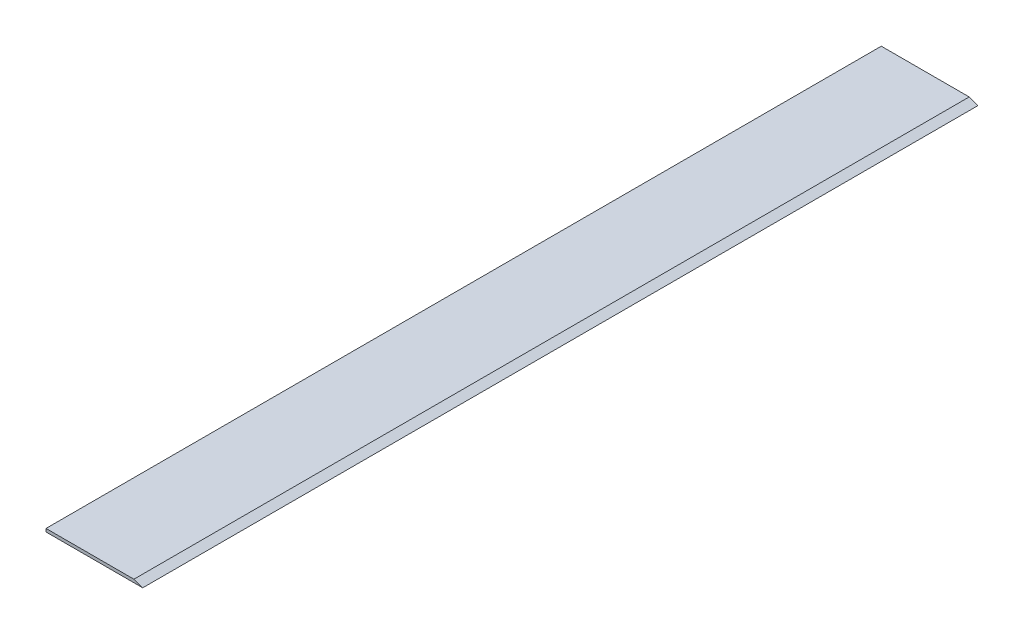
ISO-10303-21;
HEADER;
FILE_DESCRIPTION(('STEP AP214'),'2;1');
FILE_NAME('part.step','',(''),(''),'','','');
FILE_SCHEMA(('AUTOMOTIVE_DESIGN { 1 0 10303 214 1 1 1 1 }'));
ENDSEC;
DATA;
#1=APPLICATION_CONTEXT('core data for automotive mechanical design processes');
#2=APPLICATION_PROTOCOL_DEFINITION('international standard','automotive_design',2000,#1);
#3=PRODUCT_CONTEXT('',#1,'mechanical');
#4=PRODUCT('Part','Part','',(#3));
#5=PRODUCT_RELATED_PRODUCT_CATEGORY('part','',(#4));
#6=PRODUCT_DEFINITION_FORMATION('','',#4);
#7=PRODUCT_DEFINITION_CONTEXT('part definition',#1,'design');
#8=PRODUCT_DEFINITION('design','',#6,#7);
#9=PRODUCT_DEFINITION_SHAPE('','',#8);
#10=(LENGTH_UNIT() NAMED_UNIT(*) SI_UNIT(.MILLI.,.METRE.));
#11=(NAMED_UNIT(*) PLANE_ANGLE_UNIT() SI_UNIT($,.RADIAN.));
#12=(NAMED_UNIT(*) SI_UNIT($,.STERADIAN.) SOLID_ANGLE_UNIT());
#13=UNCERTAINTY_MEASURE_WITH_UNIT(LENGTH_MEASURE(1.E-05),#10,'distance_accuracy_value','');
#14=(GEOMETRIC_REPRESENTATION_CONTEXT(3) GLOBAL_UNCERTAINTY_ASSIGNED_CONTEXT((#13)) GLOBAL_UNIT_ASSIGNED_CONTEXT((#10,
#11,#12)) REPRESENTATION_CONTEXT('',''));
#15=CARTESIAN_POINT('',(0.,0.,0.));
#16=DIRECTION('',(0.,0.,1.));
#17=DIRECTION('',(1.,0.,0.));
#18=AXIS2_PLACEMENT_3D('',#15,#16,#17);
#19=CARTESIAN_POINT('',(0.,0.7,190.));
#20=DIRECTION('',(1.,0.,0.));
#21=DIRECTION('',(0.,0.,-1.));
#22=AXIS2_PLACEMENT_3D('',#19,#20,#21);
#23=PLANE('',#22);
#24=DIRECTION('',(0.,-1.,0.));
#25=VECTOR('',#24,1.);
#26=CARTESIAN_POINT('',(0.,0.7,0.));
#27=LINE('',#26,#25);
#28=CARTESIAN_POINT('',(0.,0.7,0.));
#29=VERTEX_POINT('',#28);
#30=CARTESIAN_POINT('',(0.,0.,0.));
#31=VERTEX_POINT('',#30);
#32=EDGE_CURVE('E109',#29,#31,#27,.T.);
#33=ORIENTED_EDGE('',*,*,#32,.T.);
#34=DIRECTION('',(0.,0.,-1.));
#35=VECTOR('',#34,1.);
#36=CARTESIAN_POINT('',(0.,0.,190.));
#37=LINE('',#36,#35);
#38=CARTESIAN_POINT('',(0.,0.,190.));
#39=VERTEX_POINT('',#38);
#40=EDGE_CURVE('E11',#39,#31,#37,.T.);
#41=ORIENTED_EDGE('',*,*,#40,.F.);
#42=DIRECTION('',(0.,-1.,0.));
#43=VECTOR('',#42,1.);
#44=CARTESIAN_POINT('',(0.,0.7,190.));
#45=LINE('',#44,#43);
#46=CARTESIAN_POINT('',(0.,0.7,190.));
#47=VERTEX_POINT('',#46);
#48=EDGE_CURVE('E92',#47,#39,#45,.T.);
#49=ORIENTED_EDGE('',*,*,#48,.F.);
#50=DIRECTION('',(0.,0.,-1.));
#51=VECTOR('',#50,1.);
#52=CARTESIAN_POINT('',(0.,0.7,190.));
#53=LINE('',#52,#51);
#54=EDGE_CURVE('E105',#47,#29,#53,.T.);
#55=ORIENTED_EDGE('',*,*,#54,.T.);
#56=EDGE_LOOP('',(#33,#41,#49,#55));
#57=FACE_BOUND('',#56,.T.);
#58=ADVANCED_FACE('F40',(#57),#23,.F.);
#59=CARTESIAN_POINT('',(0.,0.,190.));
#60=DIRECTION('',(0.,1.,0.));
#61=DIRECTION('',(0.,0.,1.));
#62=AXIS2_PLACEMENT_3D('',#59,#60,#61);
#63=PLANE('',#62);
#64=DIRECTION('',(1.,0.,0.));
#65=VECTOR('',#64,1.);
#66=CARTESIAN_POINT('',(0.,0.,0.));
#67=LINE('',#66,#65);
#68=CARTESIAN_POINT('',(22.,0.,0.));
#69=VERTEX_POINT('',#68);
#70=EDGE_CURVE('E97',#31,#69,#67,.T.);
#71=ORIENTED_EDGE('',*,*,#70,.T.);
#72=DIRECTION('',(0.,0.,-1.));
#73=VECTOR('',#72,1.);
#74=CARTESIAN_POINT('',(22.,0.,190.));
#75=LINE('',#74,#73);
#76=CARTESIAN_POINT('',(22.,0.,190.));
#77=VERTEX_POINT('',#76);
#78=EDGE_CURVE('E49',#77,#69,#75,.T.);
#79=ORIENTED_EDGE('',*,*,#78,.F.);
#80=DIRECTION('',(1.,0.,0.));
#81=VECTOR('',#80,1.);
#82=CARTESIAN_POINT('',(0.,0.,190.));
#83=LINE('',#82,#81);
#84=EDGE_CURVE('E87',#39,#77,#83,.T.);
#85=ORIENTED_EDGE('',*,*,#84,.F.);
#86=ORIENTED_EDGE('',*,*,#40,.T.);
#87=EDGE_LOOP('',(#71,#79,#85,#86));
#88=FACE_BOUND('',#87,.T.);
#89=ADVANCED_FACE('F96',(#88),#63,.F.);
#90=CARTESIAN_POINT('',(22.,0.,190.));
#91=DIRECTION('',(-0.330350424728106,-0.943858356366017,0.));
#92=DIRECTION('',(0.943858356366017,-0.330350424728106,0.));
#93=AXIS2_PLACEMENT_3D('',#90,#91,#92);
#94=PLANE('',#93);
#95=DIRECTION('',(-0.943858356366017,0.330350424728106,0.));
#96=VECTOR('',#95,1.);
#97=CARTESIAN_POINT('',(22.,0.,0.));
#98=LINE('',#97,#96);
#99=CARTESIAN_POINT('',(20.,0.700000000000002,0.));
#100=VERTEX_POINT('',#99);
#101=EDGE_CURVE('E74',#69,#100,#98,.T.);
#102=ORIENTED_EDGE('',*,*,#101,.T.);
#103=DIRECTION('',(0.,0.,-1.));
#104=VECTOR('',#103,1.);
#105=CARTESIAN_POINT('',(20.,0.700000000000002,190.));
#106=LINE('',#105,#104);
#107=CARTESIAN_POINT('',(20.,0.700000000000002,190.));
#108=VERTEX_POINT('',#107);
#109=EDGE_CURVE('E99',#108,#100,#106,.T.);
#110=ORIENTED_EDGE('',*,*,#109,.F.);
#111=DIRECTION('',(-0.943858356366017,0.330350424728106,0.));
#112=VECTOR('',#111,1.);
#113=CARTESIAN_POINT('',(22.,0.,190.));
#114=LINE('',#113,#112);
#115=EDGE_CURVE('E90',#77,#108,#114,.T.);
#116=ORIENTED_EDGE('',*,*,#115,.F.);
#117=ORIENTED_EDGE('',*,*,#78,.T.);
#118=EDGE_LOOP('',(#102,#110,#116,#117));
#119=FACE_BOUND('',#118,.T.);
#120=ADVANCED_FACE('F100',(#119),#94,.F.);
#121=CARTESIAN_POINT('',(20.,0.700000000000002,190.));
#122=DIRECTION('',(0.,-1.,0.));
#123=DIRECTION('',(1.,0.,0.));
#124=AXIS2_PLACEMENT_3D('',#121,#122,#123);
#125=PLANE('',#124);
#126=DIRECTION('',(-1.,0.,0.));
#127=VECTOR('',#126,1.);
#128=CARTESIAN_POINT('',(20.,0.700000000000002,0.));
#129=LINE('',#128,#127);
#130=EDGE_CURVE('E80',#100,#29,#129,.T.);
#131=ORIENTED_EDGE('',*,*,#130,.T.);
#132=ORIENTED_EDGE('',*,*,#54,.F.);
#133=DIRECTION('',(-1.,0.,0.));
#134=VECTOR('',#133,1.);
#135=CARTESIAN_POINT('',(20.,0.700000000000002,190.));
#136=LINE('',#135,#134);
#137=EDGE_CURVE('E57',#108,#47,#136,.T.);
#138=ORIENTED_EDGE('',*,*,#137,.F.);
#139=ORIENTED_EDGE('',*,*,#109,.T.);
#140=EDGE_LOOP('',(#131,#132,#138,#139));
#141=FACE_BOUND('',#140,.T.);
#142=ADVANCED_FACE('F121',(#141),#125,.F.);
#143=CARTESIAN_POINT('',(0.,0.,190.));
#144=DIRECTION('',(0.,0.,1.));
#145=DIRECTION('',(1.,0.,0.));
#146=AXIS2_PLACEMENT_3D('',#143,#144,#145);
#147=PLANE('',#146);
#148=ORIENTED_EDGE('',*,*,#48,.T.);
#149=ORIENTED_EDGE('',*,*,#84,.T.);
#150=ORIENTED_EDGE('',*,*,#115,.T.);
#151=ORIENTED_EDGE('',*,*,#137,.T.);
#152=EDGE_LOOP('',(#148,#149,#150,#151));
#153=FACE_BOUND('',#152,.T.);
#154=ADVANCED_FACE('F88',(#153),#147,.T.);
#155=CARTESIAN_POINT('',(0.,0.,0.));
#156=DIRECTION('',(0.,0.,1.));
#157=DIRECTION('',(1.,0.,0.));
#158=AXIS2_PLACEMENT_3D('',#155,#156,#157);
#159=PLANE('',#158);
#160=ORIENTED_EDGE('',*,*,#32,.F.);
#161=ORIENTED_EDGE('',*,*,#130,.F.);
#162=ORIENTED_EDGE('',*,*,#101,.F.);
#163=ORIENTED_EDGE('',*,*,#70,.F.);
#164=EDGE_LOOP('',(#160,#161,#162,#163));
#165=FACE_BOUND('',#164,.T.);
#166=ADVANCED_FACE('F124',(#165),#159,.F.);
#167=CLOSED_SHELL('',(#58,#89,#120,#142,#154,#166));
#168=MANIFOLD_SOLID_BREP('B2',#167);
#169=ADVANCED_BREP_SHAPE_REPRESENTATION('',(#18,#168),#14);
#170=SHAPE_DEFINITION_REPRESENTATION(#9,#169);
ENDSEC;
END-ISO-10303-21;
